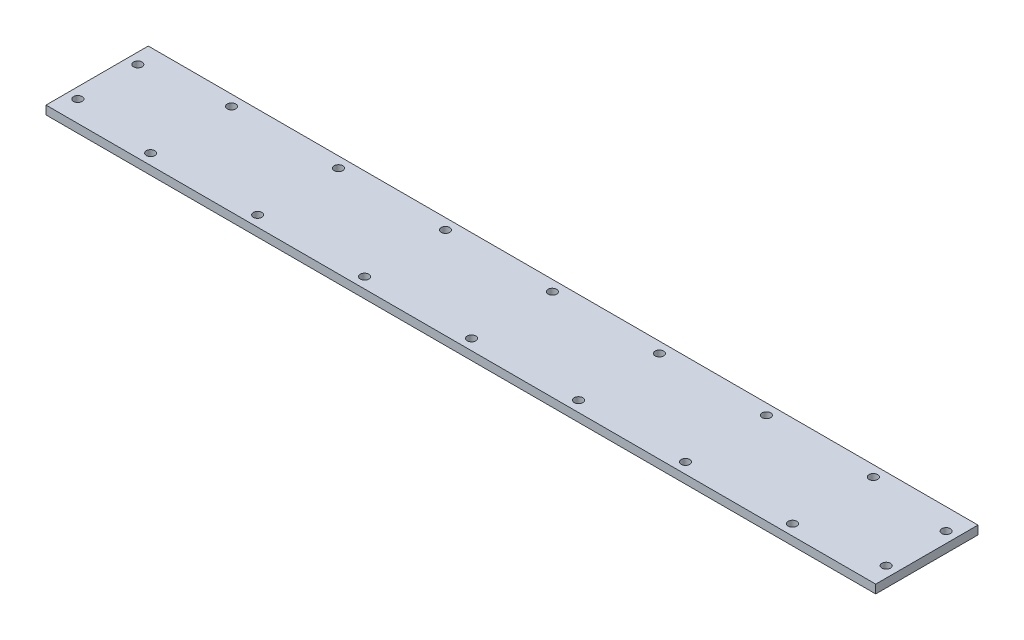
ISO-10303-21;
HEADER;
FILE_DESCRIPTION(('STEP AP214'),'2;1');
FILE_NAME('part.step','',(''),(''),'','','');
FILE_SCHEMA(('AUTOMOTIVE_DESIGN { 1 0 10303 214 1 1 1 1 }'));
ENDSEC;
DATA;
#1=APPLICATION_CONTEXT('core data for automotive mechanical design processes');
#2=APPLICATION_PROTOCOL_DEFINITION('international standard','automotive_design',2000,#1);
#3=PRODUCT_CONTEXT('',#1,'mechanical');
#4=PRODUCT('Part','Part','',(#3));
#5=PRODUCT_RELATED_PRODUCT_CATEGORY('part','',(#4));
#6=PRODUCT_DEFINITION_FORMATION('','',#4);
#7=PRODUCT_DEFINITION_CONTEXT('part definition',#1,'design');
#8=PRODUCT_DEFINITION('design','',#6,#7);
#9=PRODUCT_DEFINITION_SHAPE('','',#8);
#10=(LENGTH_UNIT() NAMED_UNIT(*) SI_UNIT(.MILLI.,.METRE.));
#11=(NAMED_UNIT(*) PLANE_ANGLE_UNIT() SI_UNIT($,.RADIAN.));
#12=(NAMED_UNIT(*) SI_UNIT($,.STERADIAN.) SOLID_ANGLE_UNIT());
#13=UNCERTAINTY_MEASURE_WITH_UNIT(LENGTH_MEASURE(1.E-05),#10,'distance_accuracy_value','');
#14=(GEOMETRIC_REPRESENTATION_CONTEXT(3) GLOBAL_UNCERTAINTY_ASSIGNED_CONTEXT((#13)) GLOBAL_UNIT_ASSIGNED_CONTEXT((#10,
#11,#12)) REPRESENTATION_CONTEXT('',''));
#15=CARTESIAN_POINT('',(0.,0.,0.));
#16=DIRECTION('',(0.,0.,1.));
#17=DIRECTION('',(1.,0.,0.));
#18=AXIS2_PLACEMENT_3D('',#15,#16,#17);
#19=CARTESIAN_POINT('',(0.,2.,0.));
#20=DIRECTION('',(0.,-1.,0.));
#21=DIRECTION('',(0.,0.,-1.));
#22=AXIS2_PLACEMENT_3D('',#19,#20,#21);
#23=PLANE('',#22);
#24=DIRECTION('',(0.,0.,-1.));
#25=VECTOR('',#24,1.);
#26=CARTESIAN_POINT('',(96.9499999999999,2.,11.95));
#27=LINE('',#26,#25);
#28=CARTESIAN_POINT('',(96.9499999999999,2.,11.95));
#29=VERTEX_POINT('',#28);
#30=CARTESIAN_POINT('',(96.9499999999999,2.,-11.95));
#31=VERTEX_POINT('',#30);
#32=EDGE_CURVE('E92',#29,#31,#27,.T.);
#33=ORIENTED_EDGE('',*,*,#32,.T.);
#34=DIRECTION('',(-1.,0.,0.));
#35=VECTOR('',#34,1.);
#36=CARTESIAN_POINT('',(-96.9500000000001,2.,-11.95));
#37=LINE('',#36,#35);
#38=CARTESIAN_POINT('',(-96.9500000000001,2.,-11.95));
#39=VERTEX_POINT('',#38);
#40=EDGE_CURVE('E87',#31,#39,#37,.T.);
#41=ORIENTED_EDGE('',*,*,#40,.T.);
#42=DIRECTION('',(0.,0.,1.));
#43=VECTOR('',#42,1.);
#44=CARTESIAN_POINT('',(-96.9500000000001,2.,11.95));
#45=LINE('',#44,#43);
#46=CARTESIAN_POINT('',(-96.9500000000001,2.,11.95));
#47=VERTEX_POINT('',#46);
#48=EDGE_CURVE('E90',#39,#47,#45,.T.);
#49=ORIENTED_EDGE('',*,*,#48,.T.);
#50=DIRECTION('',(1.,0.,0.));
#51=VECTOR('',#50,1.);
#52=CARTESIAN_POINT('',(-96.9500000000001,2.,11.95));
#53=LINE('',#52,#51);
#54=EDGE_CURVE('E57',#47,#29,#53,.T.);
#55=ORIENTED_EDGE('',*,*,#54,.T.);
#56=EDGE_LOOP('',(#33,#41,#49,#55));
#57=FACE_BOUND('',#56,.T.);
#58=CARTESIAN_POINT('',(-25.,2.,-9.45));
#59=DIRECTION('',(0.,1.,0.));
#60=DIRECTION('',(0.,0.,1.));
#61=AXIS2_PLACEMENT_3D('',#58,#59,#60);
#62=CIRCLE('',#61,1.);
#63=CARTESIAN_POINT('',(-25.,2.,-8.45));
#64=VERTEX_POINT('',#63);
#65=EDGE_CURVE('E112',#64,#64,#62,.T.);
#66=ORIENTED_EDGE('',*,*,#65,.F.);
#67=EDGE_LOOP('',(#66));
#68=FACE_BOUND('',#67,.T.);
#69=CARTESIAN_POINT('',(0.,2.,-9.45));
#70=DIRECTION('',(0.,1.,0.));
#71=DIRECTION('',(0.,0.,1.));
#72=AXIS2_PLACEMENT_3D('',#69,#70,#71);
#73=CIRCLE('',#72,1.);
#74=CARTESIAN_POINT('',(0.,2.,-8.45));
#75=VERTEX_POINT('',#74);
#76=EDGE_CURVE('E134',#75,#75,#73,.T.);
#77=ORIENTED_EDGE('',*,*,#76,.F.);
#78=EDGE_LOOP('',(#77));
#79=FACE_BOUND('',#78,.T.);
#80=CARTESIAN_POINT('',(25.,2.,-9.45));
#81=DIRECTION('',(0.,1.,0.));
#82=DIRECTION('',(0.,0.,1.));
#83=AXIS2_PLACEMENT_3D('',#80,#81,#82);
#84=CIRCLE('',#83,1.);
#85=CARTESIAN_POINT('',(25.,2.,-8.45));
#86=VERTEX_POINT('',#85);
#87=EDGE_CURVE('E142',#86,#86,#84,.T.);
#88=ORIENTED_EDGE('',*,*,#87,.F.);
#89=EDGE_LOOP('',(#88));
#90=FACE_BOUND('',#89,.T.);
#91=CARTESIAN_POINT('',(-94.4500000000001,2.,-6.99999999999933));
#92=DIRECTION('',(0.,1.,0.));
#93=DIRECTION('',(0.,0.,1.));
#94=AXIS2_PLACEMENT_3D('',#91,#92,#93);
#95=CIRCLE('',#94,1.00000000000019);
#96=CARTESIAN_POINT('',(-94.4500000000001,2.,-5.99999999999913));
#97=VERTEX_POINT('',#96);
#98=EDGE_CURVE('E150',#97,#97,#95,.T.);
#99=ORIENTED_EDGE('',*,*,#98,.F.);
#100=EDGE_LOOP('',(#99));
#101=FACE_BOUND('',#100,.T.);
#102=CARTESIAN_POINT('',(25.,2.,9.45));
#103=DIRECTION('',(0.,1.,0.));
#104=DIRECTION('',(0.,0.,-1.));
#105=AXIS2_PLACEMENT_3D('',#102,#103,#104);
#106=CIRCLE('',#105,1.);
#107=CARTESIAN_POINT('',(25.,2.,8.45));
#108=VERTEX_POINT('',#107);
#109=EDGE_CURVE('E158',#108,#108,#106,.T.);
#110=ORIENTED_EDGE('',*,*,#109,.F.);
#111=EDGE_LOOP('',(#110));
#112=FACE_BOUND('',#111,.T.);
#113=CARTESIAN_POINT('',(0.,2.,9.45));
#114=DIRECTION('',(0.,1.,0.));
#115=DIRECTION('',(0.,0.,-1.));
#116=AXIS2_PLACEMENT_3D('',#113,#114,#115);
#117=CIRCLE('',#116,1.);
#118=CARTESIAN_POINT('',(0.,2.,8.45));
#119=VERTEX_POINT('',#118);
#120=EDGE_CURVE('E166',#119,#119,#117,.T.);
#121=ORIENTED_EDGE('',*,*,#120,.F.);
#122=EDGE_LOOP('',(#121));
#123=FACE_BOUND('',#122,.T.);
#124=CARTESIAN_POINT('',(-25.,2.,9.45));
#125=DIRECTION('',(0.,1.,0.));
#126=DIRECTION('',(0.,0.,-1.));
#127=AXIS2_PLACEMENT_3D('',#124,#125,#126);
#128=CIRCLE('',#127,1.);
#129=CARTESIAN_POINT('',(-25.,2.,8.45));
#130=VERTEX_POINT('',#129);
#131=EDGE_CURVE('E174',#130,#130,#128,.T.);
#132=ORIENTED_EDGE('',*,*,#131,.F.);
#133=EDGE_LOOP('',(#132));
#134=FACE_BOUND('',#133,.T.);
#135=CARTESIAN_POINT('',(-94.4500000000001,2.,7.00000000000001));
#136=DIRECTION('',(0.,1.,0.));
#137=DIRECTION('',(0.,0.,-1.));
#138=AXIS2_PLACEMENT_3D('',#135,#136,#137);
#139=CIRCLE('',#138,0.999999999999998);
#140=CARTESIAN_POINT('',(-94.4500000000001,2.,6.00000000000001));
#141=VERTEX_POINT('',#140);
#142=EDGE_CURVE('E182',#141,#141,#139,.T.);
#143=ORIENTED_EDGE('',*,*,#142,.F.);
#144=EDGE_LOOP('',(#143));
#145=FACE_BOUND('',#144,.T.);
#146=CARTESIAN_POINT('',(94.4499999999999,2.,7.00000000000001));
#147=DIRECTION('',(0.,1.,0.));
#148=DIRECTION('',(0.,0.,1.));
#149=AXIS2_PLACEMENT_3D('',#146,#147,#148);
#150=CIRCLE('',#149,0.999999999999998);
#151=CARTESIAN_POINT('',(94.4499999999999,2.,8.00000000000001));
#152=VERTEX_POINT('',#151);
#153=EDGE_CURVE('E190',#152,#152,#150,.T.);
#154=ORIENTED_EDGE('',*,*,#153,.F.);
#155=EDGE_LOOP('',(#154));
#156=FACE_BOUND('',#155,.T.);
#157=CARTESIAN_POINT('',(94.4499999999999,2.,-7.));
#158=DIRECTION('',(0.,1.,0.));
#159=DIRECTION('',(0.,0.,-1.));
#160=AXIS2_PLACEMENT_3D('',#157,#158,#159);
#161=CIRCLE('',#160,0.999999999999998);
#162=CARTESIAN_POINT('',(94.4499999999999,2.,-8.));
#163=VERTEX_POINT('',#162);
#164=EDGE_CURVE('E198',#163,#163,#161,.T.);
#165=ORIENTED_EDGE('',*,*,#164,.F.);
#166=EDGE_LOOP('',(#165));
#167=FACE_BOUND('',#166,.T.);
#168=CARTESIAN_POINT('',(-50.,2.,-9.44999999999982));
#169=DIRECTION('',(0.,1.,0.));
#170=DIRECTION('',(0.,0.,1.));
#171=AXIS2_PLACEMENT_3D('',#168,#169,#170);
#172=CIRCLE('',#171,0.999999999999998);
#173=CARTESIAN_POINT('',(-50.,2.,-8.44999999999983));
#174=VERTEX_POINT('',#173);
#175=EDGE_CURVE('E206',#174,#174,#172,.T.);
#176=ORIENTED_EDGE('',*,*,#175,.F.);
#177=EDGE_LOOP('',(#176));
#178=FACE_BOUND('',#177,.T.);
#179=CARTESIAN_POINT('',(-75.,2.,-9.44999999999965));
#180=DIRECTION('',(0.,1.,0.));
#181=DIRECTION('',(0.,0.,1.));
#182=AXIS2_PLACEMENT_3D('',#179,#180,#181);
#183=CIRCLE('',#182,1.00000000000001);
#184=CARTESIAN_POINT('',(-75.,2.,-8.44999999999964));
#185=VERTEX_POINT('',#184);
#186=EDGE_CURVE('E214',#185,#185,#183,.T.);
#187=ORIENTED_EDGE('',*,*,#186,.F.);
#188=EDGE_LOOP('',(#187));
#189=FACE_BOUND('',#188,.T.);
#190=CARTESIAN_POINT('',(74.9999999999999,2.,-9.44999999999965));
#191=DIRECTION('',(0.,1.,0.));
#192=DIRECTION('',(0.,0.,-1.));
#193=AXIS2_PLACEMENT_3D('',#190,#191,#192);
#194=CIRCLE('',#193,0.999999999998932);
#195=CARTESIAN_POINT('',(74.9999999999999,2.,-10.4499999999986));
#196=VERTEX_POINT('',#195);
#197=EDGE_CURVE('E222',#196,#196,#194,.T.);
#198=ORIENTED_EDGE('',*,*,#197,.F.);
#199=EDGE_LOOP('',(#198));
#200=FACE_BOUND('',#199,.T.);
#201=CARTESIAN_POINT('',(50.0000000000002,2.,-9.44999999999807));
#202=DIRECTION('',(0.,1.,0.));
#203=DIRECTION('',(0.,0.,-1.));
#204=AXIS2_PLACEMENT_3D('',#201,#202,#203);
#205=CIRCLE('',#204,0.999999999999994);
#206=CARTESIAN_POINT('',(50.0000000000002,2.,-10.4499999999981));
#207=VERTEX_POINT('',#206);
#208=EDGE_CURVE('E230',#207,#207,#205,.T.);
#209=ORIENTED_EDGE('',*,*,#208,.F.);
#210=EDGE_LOOP('',(#209));
#211=FACE_BOUND('',#210,.T.);
#212=CARTESIAN_POINT('',(74.9999999999998,2.,9.44999999999958));
#213=DIRECTION('',(0.,1.,0.));
#214=DIRECTION('',(0.,0.,1.));
#215=AXIS2_PLACEMENT_3D('',#212,#213,#214);
#216=CIRCLE('',#215,0.999999999998933);
#217=CARTESIAN_POINT('',(74.9999999999998,2.,10.4499999999985));
#218=VERTEX_POINT('',#217);
#219=EDGE_CURVE('E238',#218,#218,#216,.T.);
#220=ORIENTED_EDGE('',*,*,#219,.F.);
#221=EDGE_LOOP('',(#220));
#222=FACE_BOUND('',#221,.T.);
#223=CARTESIAN_POINT('',(50.0000000000002,2.,9.44999999999802));
#224=DIRECTION('',(0.,1.,0.));
#225=DIRECTION('',(0.,0.,1.));
#226=AXIS2_PLACEMENT_3D('',#223,#224,#225);
#227=CIRCLE('',#226,0.999999999999994);
#228=CARTESIAN_POINT('',(50.0000000000002,2.,10.449999999998));
#229=VERTEX_POINT('',#228);
#230=EDGE_CURVE('E246',#229,#229,#227,.T.);
#231=ORIENTED_EDGE('',*,*,#230,.F.);
#232=EDGE_LOOP('',(#231));
#233=FACE_BOUND('',#232,.T.);
#234=CARTESIAN_POINT('',(-50.,2.,9.44999999999985));
#235=DIRECTION('',(0.,1.,0.));
#236=DIRECTION('',(0.,0.,-1.));
#237=AXIS2_PLACEMENT_3D('',#234,#235,#236);
#238=CIRCLE('',#237,0.999999999999998);
#239=CARTESIAN_POINT('',(-50.,2.,8.44999999999986));
#240=VERTEX_POINT('',#239);
#241=EDGE_CURVE('E254',#240,#240,#238,.T.);
#242=ORIENTED_EDGE('',*,*,#241,.F.);
#243=EDGE_LOOP('',(#242));
#244=FACE_BOUND('',#243,.T.);
#245=CARTESIAN_POINT('',(-75.,2.,9.4499999999997));
#246=DIRECTION('',(0.,1.,0.));
#247=DIRECTION('',(0.,0.,-1.));
#248=AXIS2_PLACEMENT_3D('',#245,#246,#247);
#249=CIRCLE('',#248,1.00000000000001);
#250=CARTESIAN_POINT('',(-75.,2.,8.44999999999969));
#251=VERTEX_POINT('',#250);
#252=EDGE_CURVE('E262',#251,#251,#249,.T.);
#253=ORIENTED_EDGE('',*,*,#252,.F.);
#254=EDGE_LOOP('',(#253));
#255=FACE_BOUND('',#254,.T.);
#256=ADVANCED_FACE('F39',(#57,#68,#79,#90,#101,#112,#123,#134,#145,#156,#167,#178,#189,#200,
#211,#222,#233,#244,#255),#23,.F.);
#257=CARTESIAN_POINT('',(0.,0.,0.));
#258=DIRECTION('',(0.,-1.,0.));
#259=DIRECTION('',(0.,0.,-1.));
#260=AXIS2_PLACEMENT_3D('',#257,#258,#259);
#261=PLANE('',#260);
#262=CARTESIAN_POINT('',(-50.,0.,9.44999999999985));
#263=DIRECTION('',(0.,1.,0.));
#264=DIRECTION('',(0.,0.,-1.));
#265=AXIS2_PLACEMENT_3D('',#262,#263,#264);
#266=CIRCLE('',#265,0.999999999999998);
#267=CARTESIAN_POINT('',(-50.,0.,8.44999999999986));
#268=VERTEX_POINT('',#267);
#269=EDGE_CURVE('E258',#268,#268,#266,.T.);
#270=ORIENTED_EDGE('',*,*,#269,.T.);
#271=EDGE_LOOP('',(#270));
#272=FACE_BOUND('',#271,.T.);
#273=CARTESIAN_POINT('',(74.9999999999998,0.,9.44999999999958));
#274=DIRECTION('',(0.,1.,0.));
#275=DIRECTION('',(0.,0.,1.));
#276=AXIS2_PLACEMENT_3D('',#273,#274,#275);
#277=CIRCLE('',#276,0.999999999998933);
#278=CARTESIAN_POINT('',(74.9999999999998,0.,10.4499999999985));
#279=VERTEX_POINT('',#278);
#280=EDGE_CURVE('E242',#279,#279,#277,.T.);
#281=ORIENTED_EDGE('',*,*,#280,.T.);
#282=EDGE_LOOP('',(#281));
#283=FACE_BOUND('',#282,.T.);
#284=CARTESIAN_POINT('',(74.9999999999999,0.,-9.44999999999965));
#285=DIRECTION('',(0.,1.,0.));
#286=DIRECTION('',(0.,0.,-1.));
#287=AXIS2_PLACEMENT_3D('',#284,#285,#286);
#288=CIRCLE('',#287,0.999999999998932);
#289=CARTESIAN_POINT('',(74.9999999999999,0.,-10.4499999999986));
#290=VERTEX_POINT('',#289);
#291=EDGE_CURVE('E226',#290,#290,#288,.T.);
#292=ORIENTED_EDGE('',*,*,#291,.T.);
#293=EDGE_LOOP('',(#292));
#294=FACE_BOUND('',#293,.T.);
#295=CARTESIAN_POINT('',(-50.,0.,-9.44999999999982));
#296=DIRECTION('',(0.,1.,0.));
#297=DIRECTION('',(0.,0.,1.));
#298=AXIS2_PLACEMENT_3D('',#295,#296,#297);
#299=CIRCLE('',#298,0.999999999999998);
#300=CARTESIAN_POINT('',(-50.,0.,-8.44999999999983));
#301=VERTEX_POINT('',#300);
#302=EDGE_CURVE('E210',#301,#301,#299,.T.);
#303=ORIENTED_EDGE('',*,*,#302,.T.);
#304=EDGE_LOOP('',(#303));
#305=FACE_BOUND('',#304,.T.);
#306=CARTESIAN_POINT('',(94.4499999999999,0.,7.00000000000001));
#307=DIRECTION('',(0.,1.,0.));
#308=DIRECTION('',(0.,0.,1.));
#309=AXIS2_PLACEMENT_3D('',#306,#307,#308);
#310=CIRCLE('',#309,0.999999999999998);
#311=CARTESIAN_POINT('',(94.4499999999999,0.,8.00000000000001));
#312=VERTEX_POINT('',#311);
#313=EDGE_CURVE('E194',#312,#312,#310,.T.);
#314=ORIENTED_EDGE('',*,*,#313,.T.);
#315=EDGE_LOOP('',(#314));
#316=FACE_BOUND('',#315,.T.);
#317=CARTESIAN_POINT('',(-25.,0.,9.45));
#318=DIRECTION('',(0.,1.,0.));
#319=DIRECTION('',(0.,0.,-1.));
#320=AXIS2_PLACEMENT_3D('',#317,#318,#319);
#321=CIRCLE('',#320,1.);
#322=CARTESIAN_POINT('',(-25.,0.,8.45));
#323=VERTEX_POINT('',#322);
#324=EDGE_CURVE('E178',#323,#323,#321,.T.);
#325=ORIENTED_EDGE('',*,*,#324,.T.);
#326=EDGE_LOOP('',(#325));
#327=FACE_BOUND('',#326,.T.);
#328=CARTESIAN_POINT('',(25.,0.,9.45));
#329=DIRECTION('',(0.,1.,0.));
#330=DIRECTION('',(0.,0.,-1.));
#331=AXIS2_PLACEMENT_3D('',#328,#329,#330);
#332=CIRCLE('',#331,1.);
#333=CARTESIAN_POINT('',(25.,0.,8.45));
#334=VERTEX_POINT('',#333);
#335=EDGE_CURVE('E162',#334,#334,#332,.T.);
#336=ORIENTED_EDGE('',*,*,#335,.T.);
#337=EDGE_LOOP('',(#336));
#338=FACE_BOUND('',#337,.T.);
#339=CARTESIAN_POINT('',(25.,0.,-9.45));
#340=DIRECTION('',(0.,1.,0.));
#341=DIRECTION('',(0.,0.,1.));
#342=AXIS2_PLACEMENT_3D('',#339,#340,#341);
#343=CIRCLE('',#342,1.);
#344=CARTESIAN_POINT('',(25.,0.,-8.45));
#345=VERTEX_POINT('',#344);
#346=EDGE_CURVE('E146',#345,#345,#343,.T.);
#347=ORIENTED_EDGE('',*,*,#346,.T.);
#348=EDGE_LOOP('',(#347));
#349=FACE_BOUND('',#348,.T.);
#350=CARTESIAN_POINT('',(-25.,0.,-9.45));
#351=DIRECTION('',(0.,1.,0.));
#352=DIRECTION('',(0.,0.,1.));
#353=AXIS2_PLACEMENT_3D('',#350,#351,#352);
#354=CIRCLE('',#353,1.);
#355=CARTESIAN_POINT('',(-25.,0.,-8.45));
#356=VERTEX_POINT('',#355);
#357=EDGE_CURVE('E130',#356,#356,#354,.T.);
#358=ORIENTED_EDGE('',*,*,#357,.T.);
#359=EDGE_LOOP('',(#358));
#360=FACE_BOUND('',#359,.T.);
#361=DIRECTION('',(0.,0.,-1.));
#362=VECTOR('',#361,1.);
#363=CARTESIAN_POINT('',(96.9499999999999,0.,11.95));
#364=LINE('',#363,#362);
#365=CARTESIAN_POINT('',(96.9499999999999,0.,11.95));
#366=VERTEX_POINT('',#365);
#367=CARTESIAN_POINT('',(96.9499999999999,0.,-11.95));
#368=VERTEX_POINT('',#367);
#369=EDGE_CURVE('E108',#366,#368,#364,.T.);
#370=ORIENTED_EDGE('',*,*,#369,.F.);
#371=DIRECTION('',(1.,0.,0.));
#372=VECTOR('',#371,1.);
#373=CARTESIAN_POINT('',(-96.9500000000001,0.,11.95));
#374=LINE('',#373,#372);
#375=CARTESIAN_POINT('',(-96.9500000000001,0.,11.95));
#376=VERTEX_POINT('',#375);
#377=EDGE_CURVE('E80',#376,#366,#374,.T.);
#378=ORIENTED_EDGE('',*,*,#377,.F.);
#379=DIRECTION('',(0.,0.,1.));
#380=VECTOR('',#379,1.);
#381=CARTESIAN_POINT('',(-96.9500000000001,0.,11.95));
#382=LINE('',#381,#380);
#383=CARTESIAN_POINT('',(-96.9500000000001,0.,-11.95));
#384=VERTEX_POINT('',#383);
#385=EDGE_CURVE('E74',#384,#376,#382,.T.);
#386=ORIENTED_EDGE('',*,*,#385,.F.);
#387=DIRECTION('',(-1.,0.,0.));
#388=VECTOR('',#387,1.);
#389=CARTESIAN_POINT('',(-96.9500000000001,0.,-11.95));
#390=LINE('',#389,#388);
#391=EDGE_CURVE('E97',#368,#384,#390,.T.);
#392=ORIENTED_EDGE('',*,*,#391,.F.);
#393=EDGE_LOOP('',(#370,#378,#386,#392));
#394=FACE_BOUND('',#393,.T.);
#395=CARTESIAN_POINT('',(0.,0.,-9.45));
#396=DIRECTION('',(0.,1.,0.));
#397=DIRECTION('',(0.,0.,1.));
#398=AXIS2_PLACEMENT_3D('',#395,#396,#397);
#399=CIRCLE('',#398,1.);
#400=CARTESIAN_POINT('',(0.,0.,-8.45));
#401=VERTEX_POINT('',#400);
#402=EDGE_CURVE('E138',#401,#401,#399,.T.);
#403=ORIENTED_EDGE('',*,*,#402,.T.);
#404=EDGE_LOOP('',(#403));
#405=FACE_BOUND('',#404,.T.);
#406=CARTESIAN_POINT('',(-94.4500000000001,0.,-6.99999999999933));
#407=DIRECTION('',(0.,1.,0.));
#408=DIRECTION('',(0.,0.,1.));
#409=AXIS2_PLACEMENT_3D('',#406,#407,#408);
#410=CIRCLE('',#409,1.00000000000019);
#411=CARTESIAN_POINT('',(-94.4500000000001,0.,-5.99999999999913));
#412=VERTEX_POINT('',#411);
#413=EDGE_CURVE('E154',#412,#412,#410,.T.);
#414=ORIENTED_EDGE('',*,*,#413,.T.);
#415=EDGE_LOOP('',(#414));
#416=FACE_BOUND('',#415,.T.);
#417=CARTESIAN_POINT('',(0.,0.,9.45));
#418=DIRECTION('',(0.,1.,0.));
#419=DIRECTION('',(0.,0.,-1.));
#420=AXIS2_PLACEMENT_3D('',#417,#418,#419);
#421=CIRCLE('',#420,1.);
#422=CARTESIAN_POINT('',(0.,0.,8.45));
#423=VERTEX_POINT('',#422);
#424=EDGE_CURVE('E170',#423,#423,#421,.T.);
#425=ORIENTED_EDGE('',*,*,#424,.T.);
#426=EDGE_LOOP('',(#425));
#427=FACE_BOUND('',#426,.T.);
#428=CARTESIAN_POINT('',(-94.4500000000001,0.,7.00000000000001));
#429=DIRECTION('',(0.,1.,0.));
#430=DIRECTION('',(0.,0.,-1.));
#431=AXIS2_PLACEMENT_3D('',#428,#429,#430);
#432=CIRCLE('',#431,0.999999999999998);
#433=CARTESIAN_POINT('',(-94.4500000000001,0.,6.00000000000001));
#434=VERTEX_POINT('',#433);
#435=EDGE_CURVE('E186',#434,#434,#432,.T.);
#436=ORIENTED_EDGE('',*,*,#435,.T.);
#437=EDGE_LOOP('',(#436));
#438=FACE_BOUND('',#437,.T.);
#439=CARTESIAN_POINT('',(94.4499999999999,0.,-7.));
#440=DIRECTION('',(0.,1.,0.));
#441=DIRECTION('',(0.,0.,-1.));
#442=AXIS2_PLACEMENT_3D('',#439,#440,#441);
#443=CIRCLE('',#442,0.999999999999998);
#444=CARTESIAN_POINT('',(94.4499999999999,0.,-8.));
#445=VERTEX_POINT('',#444);
#446=EDGE_CURVE('E202',#445,#445,#443,.T.);
#447=ORIENTED_EDGE('',*,*,#446,.T.);
#448=EDGE_LOOP('',(#447));
#449=FACE_BOUND('',#448,.T.);
#450=CARTESIAN_POINT('',(-75.,0.,-9.44999999999965));
#451=DIRECTION('',(0.,1.,0.));
#452=DIRECTION('',(0.,0.,1.));
#453=AXIS2_PLACEMENT_3D('',#450,#451,#452);
#454=CIRCLE('',#453,1.00000000000001);
#455=CARTESIAN_POINT('',(-75.,0.,-8.44999999999964));
#456=VERTEX_POINT('',#455);
#457=EDGE_CURVE('E218',#456,#456,#454,.T.);
#458=ORIENTED_EDGE('',*,*,#457,.T.);
#459=EDGE_LOOP('',(#458));
#460=FACE_BOUND('',#459,.T.);
#461=CARTESIAN_POINT('',(50.0000000000002,0.,-9.44999999999807));
#462=DIRECTION('',(0.,1.,0.));
#463=DIRECTION('',(0.,0.,-1.));
#464=AXIS2_PLACEMENT_3D('',#461,#462,#463);
#465=CIRCLE('',#464,0.999999999999994);
#466=CARTESIAN_POINT('',(50.0000000000002,0.,-10.4499999999981));
#467=VERTEX_POINT('',#466);
#468=EDGE_CURVE('E234',#467,#467,#465,.T.);
#469=ORIENTED_EDGE('',*,*,#468,.T.);
#470=EDGE_LOOP('',(#469));
#471=FACE_BOUND('',#470,.T.);
#472=CARTESIAN_POINT('',(50.0000000000002,0.,9.44999999999802));
#473=DIRECTION('',(0.,1.,0.));
#474=DIRECTION('',(0.,0.,1.));
#475=AXIS2_PLACEMENT_3D('',#472,#473,#474);
#476=CIRCLE('',#475,0.999999999999994);
#477=CARTESIAN_POINT('',(50.0000000000002,0.,10.449999999998));
#478=VERTEX_POINT('',#477);
#479=EDGE_CURVE('E250',#478,#478,#476,.T.);
#480=ORIENTED_EDGE('',*,*,#479,.T.);
#481=EDGE_LOOP('',(#480));
#482=FACE_BOUND('',#481,.T.);
#483=CARTESIAN_POINT('',(-75.,0.,9.4499999999997));
#484=DIRECTION('',(0.,1.,0.));
#485=DIRECTION('',(0.,0.,-1.));
#486=AXIS2_PLACEMENT_3D('',#483,#484,#485);
#487=CIRCLE('',#486,1.00000000000001);
#488=CARTESIAN_POINT('',(-75.,0.,8.44999999999969));
#489=VERTEX_POINT('',#488);
#490=EDGE_CURVE('E266',#489,#489,#487,.T.);
#491=ORIENTED_EDGE('',*,*,#490,.T.);
#492=EDGE_LOOP('',(#491));
#493=FACE_BOUND('',#492,.T.);
#494=ADVANCED_FACE('F125',(#272,#283,#294,#305,#316,#327,#338,#349,#360,#394,#405,#416,#427,
#438,#449,#460,#471,#482,#493),#261,.T.);
#495=CARTESIAN_POINT('',(96.9499999999999,2.,11.95));
#496=DIRECTION('',(-1.,0.,0.));
#497=DIRECTION('',(0.,0.,1.));
#498=AXIS2_PLACEMENT_3D('',#495,#496,#497);
#499=PLANE('',#498);
#500=ORIENTED_EDGE('',*,*,#369,.T.);
#501=DIRECTION('',(0.,-1.,0.));
#502=VECTOR('',#501,1.);
#503=CARTESIAN_POINT('',(96.9499999999999,2.,-11.95));
#504=LINE('',#503,#502);
#505=EDGE_CURVE('E11',#31,#368,#504,.T.);
#506=ORIENTED_EDGE('',*,*,#505,.F.);
#507=ORIENTED_EDGE('',*,*,#32,.F.);
#508=DIRECTION('',(0.,-1.,0.));
#509=VECTOR('',#508,1.);
#510=CARTESIAN_POINT('',(96.9499999999999,2.,11.95));
#511=LINE('',#510,#509);
#512=EDGE_CURVE('E104',#29,#366,#511,.T.);
#513=ORIENTED_EDGE('',*,*,#512,.T.);
#514=EDGE_LOOP('',(#500,#506,#507,#513));
#515=FACE_BOUND('',#514,.T.);
#516=ADVANCED_FACE('F41',(#515),#499,.F.);
#517=CARTESIAN_POINT('',(-96.9500000000001,2.,-11.95));
#518=DIRECTION('',(0.,0.,1.));
#519=DIRECTION('',(1.,0.,0.));
#520=AXIS2_PLACEMENT_3D('',#517,#518,#519);
#521=PLANE('',#520);
#522=ORIENTED_EDGE('',*,*,#391,.T.);
#523=DIRECTION('',(0.,-1.,0.));
#524=VECTOR('',#523,1.);
#525=CARTESIAN_POINT('',(-96.9500000000001,2.,-11.95));
#526=LINE('',#525,#524);
#527=EDGE_CURVE('E49',#39,#384,#526,.T.);
#528=ORIENTED_EDGE('',*,*,#527,.F.);
#529=ORIENTED_EDGE('',*,*,#40,.F.);
#530=ORIENTED_EDGE('',*,*,#505,.T.);
#531=EDGE_LOOP('',(#522,#528,#529,#530));
#532=FACE_BOUND('',#531,.T.);
#533=ADVANCED_FACE('F96',(#532),#521,.F.);
#534=CARTESIAN_POINT('',(-96.9500000000001,2.,11.95));
#535=DIRECTION('',(1.,0.,0.));
#536=DIRECTION('',(0.,0.,-1.));
#537=AXIS2_PLACEMENT_3D('',#534,#535,#536);
#538=PLANE('',#537);
#539=ORIENTED_EDGE('',*,*,#385,.T.);
#540=DIRECTION('',(0.,-1.,0.));
#541=VECTOR('',#540,1.);
#542=CARTESIAN_POINT('',(-96.9500000000001,2.,11.95));
#543=LINE('',#542,#541);
#544=EDGE_CURVE('E99',#47,#376,#543,.T.);
#545=ORIENTED_EDGE('',*,*,#544,.F.);
#546=ORIENTED_EDGE('',*,*,#48,.F.);
#547=ORIENTED_EDGE('',*,*,#527,.T.);
#548=EDGE_LOOP('',(#539,#545,#546,#547));
#549=FACE_BOUND('',#548,.T.);
#550=ADVANCED_FACE('F100',(#549),#538,.F.);
#551=CARTESIAN_POINT('',(-96.9500000000001,2.,11.95));
#552=DIRECTION('',(0.,0.,-1.));
#553=DIRECTION('',(-1.,0.,0.));
#554=AXIS2_PLACEMENT_3D('',#551,#552,#553);
#555=PLANE('',#554);
#556=ORIENTED_EDGE('',*,*,#377,.T.);
#557=ORIENTED_EDGE('',*,*,#512,.F.);
#558=ORIENTED_EDGE('',*,*,#54,.F.);
#559=ORIENTED_EDGE('',*,*,#544,.T.);
#560=EDGE_LOOP('',(#556,#557,#558,#559));
#561=FACE_BOUND('',#560,.T.);
#562=ADVANCED_FACE('F122',(#561),#555,.F.);
#563=CARTESIAN_POINT('',(-25.,2.,-9.45));
#564=DIRECTION('',(0.,-1.,0.));
#565=DIRECTION('',(0.,0.,-1.));
#566=AXIS2_PLACEMENT_3D('',#563,#564,#565);
#567=CYLINDRICAL_SURFACE('',#566,1.);
#568=ORIENTED_EDGE('',*,*,#65,.T.);
#569=EDGE_LOOP('',(#568));
#570=FACE_BOUND('',#569,.T.);
#571=ORIENTED_EDGE('',*,*,#357,.F.);
#572=EDGE_LOOP('',(#571));
#573=FACE_BOUND('',#572,.T.);
#574=ADVANCED_FACE('F285',(#570,#573),#567,.F.);
#575=CARTESIAN_POINT('',(0.,2.,-9.45));
#576=DIRECTION('',(0.,-1.,0.));
#577=DIRECTION('',(0.,0.,-1.));
#578=AXIS2_PLACEMENT_3D('',#575,#576,#577);
#579=CYLINDRICAL_SURFACE('',#578,1.);
#580=ORIENTED_EDGE('',*,*,#76,.T.);
#581=EDGE_LOOP('',(#580));
#582=FACE_BOUND('',#581,.T.);
#583=ORIENTED_EDGE('',*,*,#402,.F.);
#584=EDGE_LOOP('',(#583));
#585=FACE_BOUND('',#584,.T.);
#586=ADVANCED_FACE('F331',(#582,#585),#579,.F.);
#587=CARTESIAN_POINT('',(25.,2.,-9.45));
#588=DIRECTION('',(0.,-1.,0.));
#589=DIRECTION('',(0.,0.,-1.));
#590=AXIS2_PLACEMENT_3D('',#587,#588,#589);
#591=CYLINDRICAL_SURFACE('',#590,1.);
#592=ORIENTED_EDGE('',*,*,#87,.T.);
#593=EDGE_LOOP('',(#592));
#594=FACE_BOUND('',#593,.T.);
#595=ORIENTED_EDGE('',*,*,#346,.F.);
#596=EDGE_LOOP('',(#595));
#597=FACE_BOUND('',#596,.T.);
#598=ADVANCED_FACE('F339',(#594,#597),#591,.F.);
#599=CARTESIAN_POINT('',(-94.4500000000001,2.,-6.99999999999933));
#600=DIRECTION('',(0.,-1.,0.));
#601=DIRECTION('',(0.,0.,-1.));
#602=AXIS2_PLACEMENT_3D('',#599,#600,#601);
#603=CYLINDRICAL_SURFACE('',#602,1.00000000000019);
#604=ORIENTED_EDGE('',*,*,#98,.T.);
#605=EDGE_LOOP('',(#604));
#606=FACE_BOUND('',#605,.T.);
#607=ORIENTED_EDGE('',*,*,#413,.F.);
#608=EDGE_LOOP('',(#607));
#609=FACE_BOUND('',#608,.T.);
#610=ADVANCED_FACE('F347',(#606,#609),#603,.F.);
#611=CARTESIAN_POINT('',(25.,2.,9.45));
#612=DIRECTION('',(0.,-1.,0.));
#613=DIRECTION('',(0.,0.,-1.));
#614=AXIS2_PLACEMENT_3D('',#611,#612,#613);
#615=CYLINDRICAL_SURFACE('',#614,1.);
#616=ORIENTED_EDGE('',*,*,#109,.T.);
#617=EDGE_LOOP('',(#616));
#618=FACE_BOUND('',#617,.T.);
#619=ORIENTED_EDGE('',*,*,#335,.F.);
#620=EDGE_LOOP('',(#619));
#621=FACE_BOUND('',#620,.T.);
#622=ADVANCED_FACE('F356',(#618,#621),#615,.F.);
#623=CARTESIAN_POINT('',(0.,2.,9.45));
#624=DIRECTION('',(0.,-1.,0.));
#625=DIRECTION('',(0.,0.,-1.));
#626=AXIS2_PLACEMENT_3D('',#623,#624,#625);
#627=CYLINDRICAL_SURFACE('',#626,1.);
#628=ORIENTED_EDGE('',*,*,#120,.T.);
#629=EDGE_LOOP('',(#628));
#630=FACE_BOUND('',#629,.T.);
#631=ORIENTED_EDGE('',*,*,#424,.F.);
#632=EDGE_LOOP('',(#631));
#633=FACE_BOUND('',#632,.T.);
#634=ADVANCED_FACE('F365',(#630,#633),#627,.F.);
#635=CARTESIAN_POINT('',(-25.,2.,9.45));
#636=DIRECTION('',(0.,-1.,0.));
#637=DIRECTION('',(0.,0.,-1.));
#638=AXIS2_PLACEMENT_3D('',#635,#636,#637);
#639=CYLINDRICAL_SURFACE('',#638,1.);
#640=ORIENTED_EDGE('',*,*,#131,.T.);
#641=EDGE_LOOP('',(#640));
#642=FACE_BOUND('',#641,.T.);
#643=ORIENTED_EDGE('',*,*,#324,.F.);
#644=EDGE_LOOP('',(#643));
#645=FACE_BOUND('',#644,.T.);
#646=ADVANCED_FACE('F374',(#642,#645),#639,.F.);
#647=CARTESIAN_POINT('',(-94.4500000000001,2.,7.00000000000001));
#648=DIRECTION('',(0.,-1.,0.));
#649=DIRECTION('',(0.,0.,-1.));
#650=AXIS2_PLACEMENT_3D('',#647,#648,#649);
#651=CYLINDRICAL_SURFACE('',#650,0.999999999999998);
#652=ORIENTED_EDGE('',*,*,#142,.T.);
#653=EDGE_LOOP('',(#652));
#654=FACE_BOUND('',#653,.T.);
#655=ORIENTED_EDGE('',*,*,#435,.F.);
#656=EDGE_LOOP('',(#655));
#657=FACE_BOUND('',#656,.T.);
#658=ADVANCED_FACE('F383',(#654,#657),#651,.F.);
#659=CARTESIAN_POINT('',(94.4499999999999,2.,7.00000000000001));
#660=DIRECTION('',(0.,-1.,0.));
#661=DIRECTION('',(0.,0.,-1.));
#662=AXIS2_PLACEMENT_3D('',#659,#660,#661);
#663=CYLINDRICAL_SURFACE('',#662,0.999999999999998);
#664=ORIENTED_EDGE('',*,*,#153,.T.);
#665=EDGE_LOOP('',(#664));
#666=FACE_BOUND('',#665,.T.);
#667=ORIENTED_EDGE('',*,*,#313,.F.);
#668=EDGE_LOOP('',(#667));
#669=FACE_BOUND('',#668,.T.);
#670=ADVANCED_FACE('F392',(#666,#669),#663,.F.);
#671=CARTESIAN_POINT('',(94.4499999999999,2.,-7.));
#672=DIRECTION('',(0.,-1.,0.));
#673=DIRECTION('',(0.,0.,-1.));
#674=AXIS2_PLACEMENT_3D('',#671,#672,#673);
#675=CYLINDRICAL_SURFACE('',#674,0.999999999999998);
#676=ORIENTED_EDGE('',*,*,#164,.T.);
#677=EDGE_LOOP('',(#676));
#678=FACE_BOUND('',#677,.T.);
#679=ORIENTED_EDGE('',*,*,#446,.F.);
#680=EDGE_LOOP('',(#679));
#681=FACE_BOUND('',#680,.T.);
#682=ADVANCED_FACE('F401',(#678,#681),#675,.F.);
#683=CARTESIAN_POINT('',(-50.,2.,-9.44999999999982));
#684=DIRECTION('',(0.,-1.,0.));
#685=DIRECTION('',(0.,0.,-1.));
#686=AXIS2_PLACEMENT_3D('',#683,#684,#685);
#687=CYLINDRICAL_SURFACE('',#686,0.999999999999998);
#688=ORIENTED_EDGE('',*,*,#175,.T.);
#689=EDGE_LOOP('',(#688));
#690=FACE_BOUND('',#689,.T.);
#691=ORIENTED_EDGE('',*,*,#302,.F.);
#692=EDGE_LOOP('',(#691));
#693=FACE_BOUND('',#692,.T.);
#694=ADVANCED_FACE('F410',(#690,#693),#687,.F.);
#695=CARTESIAN_POINT('',(-75.,2.,-9.44999999999965));
#696=DIRECTION('',(0.,-1.,0.));
#697=DIRECTION('',(0.,0.,-1.));
#698=AXIS2_PLACEMENT_3D('',#695,#696,#697);
#699=CYLINDRICAL_SURFACE('',#698,1.00000000000001);
#700=ORIENTED_EDGE('',*,*,#186,.T.);
#701=EDGE_LOOP('',(#700));
#702=FACE_BOUND('',#701,.T.);
#703=ORIENTED_EDGE('',*,*,#457,.F.);
#704=EDGE_LOOP('',(#703));
#705=FACE_BOUND('',#704,.T.);
#706=ADVANCED_FACE('F419',(#702,#705),#699,.F.);
#707=CARTESIAN_POINT('',(74.9999999999999,2.,-9.44999999999965));
#708=DIRECTION('',(0.,-1.,0.));
#709=DIRECTION('',(0.,0.,-1.));
#710=AXIS2_PLACEMENT_3D('',#707,#708,#709);
#711=CYLINDRICAL_SURFACE('',#710,0.999999999998932);
#712=ORIENTED_EDGE('',*,*,#197,.T.);
#713=EDGE_LOOP('',(#712));
#714=FACE_BOUND('',#713,.T.);
#715=ORIENTED_EDGE('',*,*,#291,.F.);
#716=EDGE_LOOP('',(#715));
#717=FACE_BOUND('',#716,.T.);
#718=ADVANCED_FACE('F428',(#714,#717),#711,.F.);
#719=CARTESIAN_POINT('',(50.0000000000002,2.,-9.44999999999807));
#720=DIRECTION('',(0.,-1.,0.));
#721=DIRECTION('',(0.,0.,-1.));
#722=AXIS2_PLACEMENT_3D('',#719,#720,#721);
#723=CYLINDRICAL_SURFACE('',#722,0.999999999999994);
#724=ORIENTED_EDGE('',*,*,#208,.T.);
#725=EDGE_LOOP('',(#724));
#726=FACE_BOUND('',#725,.T.);
#727=ORIENTED_EDGE('',*,*,#468,.F.);
#728=EDGE_LOOP('',(#727));
#729=FACE_BOUND('',#728,.T.);
#730=ADVANCED_FACE('F437',(#726,#729),#723,.F.);
#731=CARTESIAN_POINT('',(74.9999999999998,2.,9.44999999999958));
#732=DIRECTION('',(0.,-1.,0.));
#733=DIRECTION('',(0.,0.,-1.));
#734=AXIS2_PLACEMENT_3D('',#731,#732,#733);
#735=CYLINDRICAL_SURFACE('',#734,0.999999999998933);
#736=ORIENTED_EDGE('',*,*,#219,.T.);
#737=EDGE_LOOP('',(#736));
#738=FACE_BOUND('',#737,.T.);
#739=ORIENTED_EDGE('',*,*,#280,.F.);
#740=EDGE_LOOP('',(#739));
#741=FACE_BOUND('',#740,.T.);
#742=ADVANCED_FACE('F446',(#738,#741),#735,.F.);
#743=CARTESIAN_POINT('',(50.0000000000002,2.,9.44999999999802));
#744=DIRECTION('',(0.,-1.,0.));
#745=DIRECTION('',(0.,0.,-1.));
#746=AXIS2_PLACEMENT_3D('',#743,#744,#745);
#747=CYLINDRICAL_SURFACE('',#746,0.999999999999994);
#748=ORIENTED_EDGE('',*,*,#230,.T.);
#749=EDGE_LOOP('',(#748));
#750=FACE_BOUND('',#749,.T.);
#751=ORIENTED_EDGE('',*,*,#479,.F.);
#752=EDGE_LOOP('',(#751));
#753=FACE_BOUND('',#752,.T.);
#754=ADVANCED_FACE('F455',(#750,#753),#747,.F.);
#755=CARTESIAN_POINT('',(-50.,2.,9.44999999999985));
#756=DIRECTION('',(0.,-1.,0.));
#757=DIRECTION('',(0.,0.,-1.));
#758=AXIS2_PLACEMENT_3D('',#755,#756,#757);
#759=CYLINDRICAL_SURFACE('',#758,0.999999999999998);
#760=ORIENTED_EDGE('',*,*,#241,.T.);
#761=EDGE_LOOP('',(#760));
#762=FACE_BOUND('',#761,.T.);
#763=ORIENTED_EDGE('',*,*,#269,.F.);
#764=EDGE_LOOP('',(#763));
#765=FACE_BOUND('',#764,.T.);
#766=ADVANCED_FACE('F464',(#762,#765),#759,.F.);
#767=CARTESIAN_POINT('',(-75.,2.,9.4499999999997));
#768=DIRECTION('',(0.,-1.,0.));
#769=DIRECTION('',(0.,0.,-1.));
#770=AXIS2_PLACEMENT_3D('',#767,#768,#769);
#771=CYLINDRICAL_SURFACE('',#770,1.00000000000001);
#772=ORIENTED_EDGE('',*,*,#252,.T.);
#773=EDGE_LOOP('',(#772));
#774=FACE_BOUND('',#773,.T.);
#775=ORIENTED_EDGE('',*,*,#490,.F.);
#776=EDGE_LOOP('',(#775));
#777=FACE_BOUND('',#776,.T.);
#778=ADVANCED_FACE('F274',(#774,#777),#771,.F.);
#779=CLOSED_SHELL('',(#256,#494,#516,#533,#550,#562,#574,#586,#598,#610,#622,#634,#646,#658,
#670,#682,#694,#706,#718,#730,#742,#754,#766,#778));
#780=MANIFOLD_SOLID_BREP('B2',#779);
#781=ADVANCED_BREP_SHAPE_REPRESENTATION('',(#18,#780),#14);
#782=SHAPE_DEFINITION_REPRESENTATION(#9,#781);
ENDSEC;
END-ISO-10303-21;
